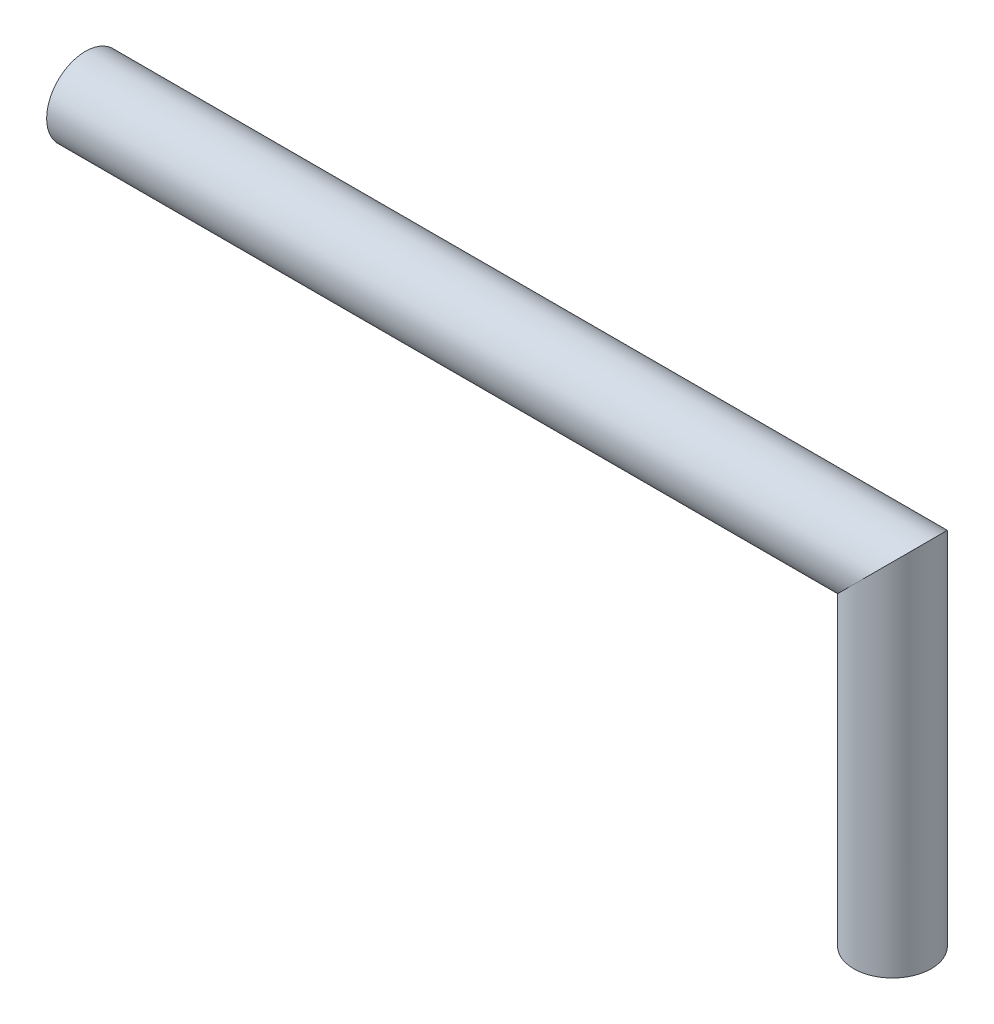
ISO-10303-21;
HEADER;
FILE_DESCRIPTION(('STEP AP214'),'2;1');
FILE_NAME('part.step','',(''),(''),'','','');
FILE_SCHEMA(('AUTOMOTIVE_DESIGN { 1 0 10303 214 1 1 1 1 }'));
ENDSEC;
DATA;
#1=APPLICATION_CONTEXT('core data for automotive mechanical design processes');
#2=APPLICATION_PROTOCOL_DEFINITION('international standard','automotive_design',2000,#1);
#3=PRODUCT_CONTEXT('',#1,'mechanical');
#4=PRODUCT('Part','Part','',(#3));
#5=PRODUCT_RELATED_PRODUCT_CATEGORY('part','',(#4));
#6=PRODUCT_DEFINITION_FORMATION('','',#4);
#7=PRODUCT_DEFINITION_CONTEXT('part definition',#1,'design');
#8=PRODUCT_DEFINITION('design','',#6,#7);
#9=PRODUCT_DEFINITION_SHAPE('','',#8);
#10=(LENGTH_UNIT() NAMED_UNIT(*) SI_UNIT(.MILLI.,.METRE.));
#11=(NAMED_UNIT(*) PLANE_ANGLE_UNIT() SI_UNIT($,.RADIAN.));
#12=(NAMED_UNIT(*) SI_UNIT($,.STERADIAN.) SOLID_ANGLE_UNIT());
#13=UNCERTAINTY_MEASURE_WITH_UNIT(LENGTH_MEASURE(1.E-05),#10,'distance_accuracy_value','');
#14=(GEOMETRIC_REPRESENTATION_CONTEXT(3) GLOBAL_UNCERTAINTY_ASSIGNED_CONTEXT((#13)) GLOBAL_UNIT_ASSIGNED_CONTEXT((#10,
#11,#12)) REPRESENTATION_CONTEXT('',''));
#15=CARTESIAN_POINT('',(0.,0.,0.));
#16=DIRECTION('',(0.,0.,1.));
#17=DIRECTION('',(1.,0.,0.));
#18=AXIS2_PLACEMENT_3D('',#15,#16,#17);
#19=CARTESIAN_POINT('',(0.,-30.4928934010152,0.));
#20=DIRECTION('',(0.,1.,0.));
#21=DIRECTION('',(0.,0.,1.));
#22=AXIS2_PLACEMENT_3D('',#19,#20,#21);
#23=PLANE('',#22);
#24=CARTESIAN_POINT('',(0.,-30.4928934010152,0.));
#25=DIRECTION('',(0.,1.,0.));
#26=DIRECTION('',(0.,0.,1.));
#27=AXIS2_PLACEMENT_3D('',#24,#25,#26);
#28=CIRCLE('',#27,3.556);
#29=CARTESIAN_POINT('',(0.,-30.4928934010152,3.556));
#30=VERTEX_POINT('',#29);
#31=EDGE_CURVE('E41',#30,#30,#28,.T.);
#32=ORIENTED_EDGE('',*,*,#31,.F.);
#33=EDGE_LOOP('',(#32));
#34=FACE_BOUND('',#33,.T.);
#35=ADVANCED_FACE('F38',(#34),#23,.F.);
#36=CARTESIAN_POINT('',(-73.927538071066,0.,0.));
#37=DIRECTION('',(-1.,0.,0.));
#38=DIRECTION('',(0.,0.,1.));
#39=AXIS2_PLACEMENT_3D('',#36,#37,#38);
#40=PLANE('',#39);
#41=CARTESIAN_POINT('',(-73.927538071066,0.,0.));
#42=DIRECTION('',(-1.,0.,0.));
#43=DIRECTION('',(0.,0.,1.));
#44=AXIS2_PLACEMENT_3D('',#41,#42,#43);
#45=CIRCLE('',#44,3.556);
#46=CARTESIAN_POINT('',(-73.927538071066,0.,3.556));
#47=VERTEX_POINT('',#46);
#48=EDGE_CURVE('E45',#47,#47,#45,.T.);
#49=ORIENTED_EDGE('',*,*,#48,.T.);
#50=EDGE_LOOP('',(#49));
#51=FACE_BOUND('',#50,.T.);
#52=ADVANCED_FACE('F58',(#51),#40,.T.);
#53=CARTESIAN_POINT('',(0.,7.9232,0.));
#54=DIRECTION('',(0.,-1.,0.));
#55=DIRECTION('',(0.,0.,-1.));
#56=AXIS2_PLACEMENT_3D('',#53,#54,#55);
#57=CYLINDRICAL_SURFACE('',#56,3.556);
#58=CARTESIAN_POINT('',(0.,0.,0.));
#59=DIRECTION('',(0.707106781186548,-0.707106781186548,0.));
#60=DIRECTION('',(0.707106781186548,0.707106781186548,0.));
#61=AXIS2_PLACEMENT_3D('',#58,#59,#60);
#62=ELLIPSE('',#61,5.02894342779873,3.556);
#63=CARTESIAN_POINT('',(3.556,3.556,0.));
#64=VERTEX_POINT('',#63);
#65=EDGE_CURVE('E11',#64,#64,#62,.T.);
#66=ORIENTED_EDGE('',*,*,#65,.T.);
#67=EDGE_LOOP('',(#66));
#68=FACE_BOUND('',#67,.T.);
#69=ORIENTED_EDGE('',*,*,#31,.T.);
#70=EDGE_LOOP('',(#69));
#71=FACE_BOUND('',#70,.T.);
#72=ADVANCED_FACE('F55',(#68,#71),#57,.T.);
#73=CARTESIAN_POINT('',(-73.927538071066,0.,0.));
#74=DIRECTION('',(1.,0.,0.));
#75=DIRECTION('',(0.,0.,-1.));
#76=AXIS2_PLACEMENT_3D('',#73,#74,#75);
#77=CYLINDRICAL_SURFACE('',#76,3.556);
#78=ORIENTED_EDGE('',*,*,#48,.F.);
#79=EDGE_LOOP('',(#78));
#80=FACE_BOUND('',#79,.T.);
#81=ORIENTED_EDGE('',*,*,#65,.F.);
#82=EDGE_LOOP('',(#81));
#83=FACE_BOUND('',#82,.T.);
#84=ADVANCED_FACE('F62',(#80,#83),#77,.T.);
#85=CLOSED_SHELL('',(#35,#52,#72,#84));
#86=MANIFOLD_SOLID_BREP('B2',#85);
#87=ADVANCED_BREP_SHAPE_REPRESENTATION('',(#18,#86),#14);
#88=SHAPE_DEFINITION_REPRESENTATION(#9,#87);
ENDSEC;
END-ISO-10303-21;
